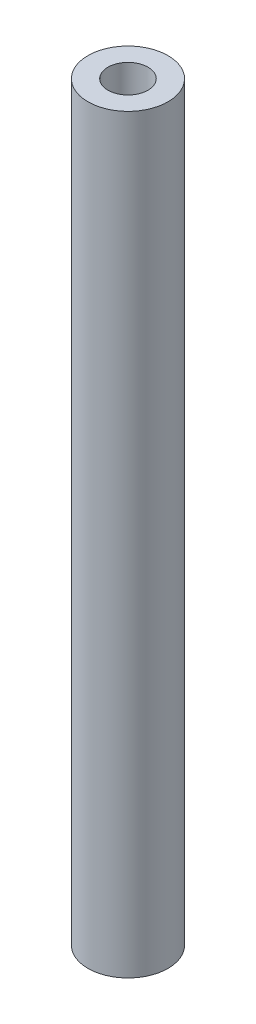
ISO-10303-21;
HEADER;
FILE_DESCRIPTION(('STEP AP214'),'2;1');
FILE_NAME('part.step','',(''),(''),'','','');
FILE_SCHEMA(('AUTOMOTIVE_DESIGN { 1 0 10303 214 1 1 1 1 }'));
ENDSEC;
DATA;
#1=APPLICATION_CONTEXT('core data for automotive mechanical design processes');
#2=APPLICATION_PROTOCOL_DEFINITION('international standard','automotive_design',2000,#1);
#3=PRODUCT_CONTEXT('',#1,'mechanical');
#4=PRODUCT('Part','Part','',(#3));
#5=PRODUCT_RELATED_PRODUCT_CATEGORY('part','',(#4));
#6=PRODUCT_DEFINITION_FORMATION('','',#4);
#7=PRODUCT_DEFINITION_CONTEXT('part definition',#1,'design');
#8=PRODUCT_DEFINITION('design','',#6,#7);
#9=PRODUCT_DEFINITION_SHAPE('','',#8);
#10=(LENGTH_UNIT() NAMED_UNIT(*) SI_UNIT(.MILLI.,.METRE.));
#11=(NAMED_UNIT(*) PLANE_ANGLE_UNIT() SI_UNIT($,.RADIAN.));
#12=(NAMED_UNIT(*) SI_UNIT($,.STERADIAN.) SOLID_ANGLE_UNIT());
#13=UNCERTAINTY_MEASURE_WITH_UNIT(LENGTH_MEASURE(1.E-05),#10,'distance_accuracy_value','');
#14=(GEOMETRIC_REPRESENTATION_CONTEXT(3) GLOBAL_UNCERTAINTY_ASSIGNED_CONTEXT((#13)) GLOBAL_UNIT_ASSIGNED_CONTEXT((#10,
#11,#12)) REPRESENTATION_CONTEXT('',''));
#15=CARTESIAN_POINT('',(0.,0.,0.));
#16=DIRECTION('',(0.,0.,1.));
#17=DIRECTION('',(1.,0.,0.));
#18=AXIS2_PLACEMENT_3D('',#15,#16,#17);
#19=CARTESIAN_POINT('',(0.,75.,0.));
#20=DIRECTION('',(0.,-1.,0.));
#21=DIRECTION('',(0.,0.,-1.));
#22=AXIS2_PLACEMENT_3D('',#19,#20,#21);
#23=CYLINDRICAL_SURFACE('',#22,4.);
#24=CARTESIAN_POINT('',(0.,75.,0.));
#25=DIRECTION('',(0.,1.,0.));
#26=DIRECTION('',(0.,0.,1.));
#27=AXIS2_PLACEMENT_3D('',#24,#25,#26);
#28=CIRCLE('',#27,4.);
#29=CARTESIAN_POINT('',(0.,75.,4.));
#30=VERTEX_POINT('',#29);
#31=EDGE_CURVE('E10',#30,#30,#28,.T.);
#32=ORIENTED_EDGE('',*,*,#31,.F.);
#33=EDGE_LOOP('',(#32));
#34=FACE_BOUND('',#33,.T.);
#35=CARTESIAN_POINT('',(0.,0.,0.));
#36=DIRECTION('',(0.,1.,0.));
#37=DIRECTION('',(0.,0.,1.));
#38=AXIS2_PLACEMENT_3D('',#35,#36,#37);
#39=CIRCLE('',#38,4.);
#40=CARTESIAN_POINT('',(0.,0.,4.));
#41=VERTEX_POINT('',#40);
#42=EDGE_CURVE('E35',#41,#41,#39,.T.);
#43=ORIENTED_EDGE('',*,*,#42,.T.);
#44=EDGE_LOOP('',(#43));
#45=FACE_BOUND('',#44,.T.);
#46=ADVANCED_FACE('F32',(#34,#45),#23,.T.);
#47=CARTESIAN_POINT('',(0.,75.,0.));
#48=DIRECTION('',(0.,1.,0.));
#49=DIRECTION('',(0.,0.,1.));
#50=AXIS2_PLACEMENT_3D('',#47,#48,#49);
#51=PLANE('',#50);
#52=CARTESIAN_POINT('',(0.,75.,0.));
#53=DIRECTION('',(0.,1.,0.));
#54=DIRECTION('',(0.,0.,1.));
#55=AXIS2_PLACEMENT_3D('',#52,#53,#54);
#56=CIRCLE('',#55,2.);
#57=CARTESIAN_POINT('',(0.,75.,2.));
#58=VERTEX_POINT('',#57);
#59=EDGE_CURVE('E44',#58,#58,#56,.T.);
#60=ORIENTED_EDGE('',*,*,#59,.F.);
#61=EDGE_LOOP('',(#60));
#62=FACE_BOUND('',#61,.T.);
#63=ORIENTED_EDGE('',*,*,#31,.T.);
#64=EDGE_LOOP('',(#63));
#65=FACE_BOUND('',#64,.T.);
#66=ADVANCED_FACE('F69',(#62,#65),#51,.T.);
#67=CARTESIAN_POINT('',(0.,0.,0.));
#68=DIRECTION('',(0.,1.,0.));
#69=DIRECTION('',(0.,0.,1.));
#70=AXIS2_PLACEMENT_3D('',#67,#68,#69);
#71=PLANE('',#70);
#72=CARTESIAN_POINT('',(0.,0.,0.));
#73=DIRECTION('',(0.,-1.,0.));
#74=DIRECTION('',(0.,0.,-1.));
#75=AXIS2_PLACEMENT_3D('',#72,#73,#74);
#76=CIRCLE('',#75,2.);
#77=CARTESIAN_POINT('',(0.,0.,-2.));
#78=VERTEX_POINT('',#77);
#79=EDGE_CURVE('E50',#78,#78,#76,.T.);
#80=ORIENTED_EDGE('',*,*,#79,.F.);
#81=EDGE_LOOP('',(#80));
#82=FACE_BOUND('',#81,.T.);
#83=ORIENTED_EDGE('',*,*,#42,.F.);
#84=EDGE_LOOP('',(#83));
#85=FACE_BOUND('',#84,.T.);
#86=ADVANCED_FACE('F65',(#82,#85),#71,.F.);
#87=CARTESIAN_POINT('',(0.,71.,0.));
#88=DIRECTION('',(0.,1.,0.));
#89=DIRECTION('',(0.,0.,1.));
#90=AXIS2_PLACEMENT_3D('',#87,#88,#89);
#91=CYLINDRICAL_SURFACE('',#90,2.);
#92=CARTESIAN_POINT('',(0.,71.,0.));
#93=DIRECTION('',(0.,1.,0.));
#94=DIRECTION('',(0.,0.,1.));
#95=AXIS2_PLACEMENT_3D('',#92,#93,#94);
#96=CIRCLE('',#95,2.);
#97=CARTESIAN_POINT('',(0.,71.,2.));
#98=VERTEX_POINT('',#97);
#99=EDGE_CURVE('E42',#98,#98,#96,.T.);
#100=ORIENTED_EDGE('',*,*,#99,.F.);
#101=EDGE_LOOP('',(#100));
#102=FACE_BOUND('',#101,.T.);
#103=ORIENTED_EDGE('',*,*,#59,.T.);
#104=EDGE_LOOP('',(#103));
#105=FACE_BOUND('',#104,.T.);
#106=ADVANCED_FACE('F68',(#102,#105),#91,.F.);
#107=CARTESIAN_POINT('',(0.,71.,0.));
#108=DIRECTION('',(0.,1.,0.));
#109=DIRECTION('',(0.,0.,1.));
#110=AXIS2_PLACEMENT_3D('',#107,#108,#109);
#111=PLANE('',#110);
#112=ORIENTED_EDGE('',*,*,#99,.T.);
#113=EDGE_LOOP('',(#112));
#114=FACE_BOUND('',#113,.T.);
#115=ADVANCED_FACE('F61',(#114),#111,.T.);
#116=CARTESIAN_POINT('',(0.,4.,0.));
#117=DIRECTION('',(0.,-1.,0.));
#118=DIRECTION('',(0.,0.,-1.));
#119=AXIS2_PLACEMENT_3D('',#116,#117,#118);
#120=CYLINDRICAL_SURFACE('',#119,2.);
#121=CARTESIAN_POINT('',(0.,4.,0.));
#122=DIRECTION('',(0.,-1.,0.));
#123=DIRECTION('',(0.,0.,-1.));
#124=AXIS2_PLACEMENT_3D('',#121,#122,#123);
#125=CIRCLE('',#124,2.);
#126=CARTESIAN_POINT('',(0.,4.,-2.));
#127=VERTEX_POINT('',#126);
#128=EDGE_CURVE('E47',#127,#127,#125,.T.);
#129=ORIENTED_EDGE('',*,*,#128,.F.);
#130=EDGE_LOOP('',(#129));
#131=FACE_BOUND('',#130,.T.);
#132=ORIENTED_EDGE('',*,*,#79,.T.);
#133=EDGE_LOOP('',(#132));
#134=FACE_BOUND('',#133,.T.);
#135=ADVANCED_FACE('F58',(#131,#134),#120,.F.);
#136=CARTESIAN_POINT('',(0.,4.,0.));
#137=DIRECTION('',(0.,-1.,0.));
#138=DIRECTION('',(0.,0.,-1.));
#139=AXIS2_PLACEMENT_3D('',#136,#137,#138);
#140=PLANE('',#139);
#141=ORIENTED_EDGE('',*,*,#128,.T.);
#142=EDGE_LOOP('',(#141));
#143=FACE_BOUND('',#142,.T.);
#144=ADVANCED_FACE('F56',(#143),#140,.T.);
#145=CLOSED_SHELL('',(#46,#66,#86,#106,#115,#135,#144));
#146=MANIFOLD_SOLID_BREP('B2',#145);
#147=ADVANCED_BREP_SHAPE_REPRESENTATION('',(#18,#146),#14);
#148=SHAPE_DEFINITION_REPRESENTATION(#9,#147);
ENDSEC;
END-ISO-10303-21;
